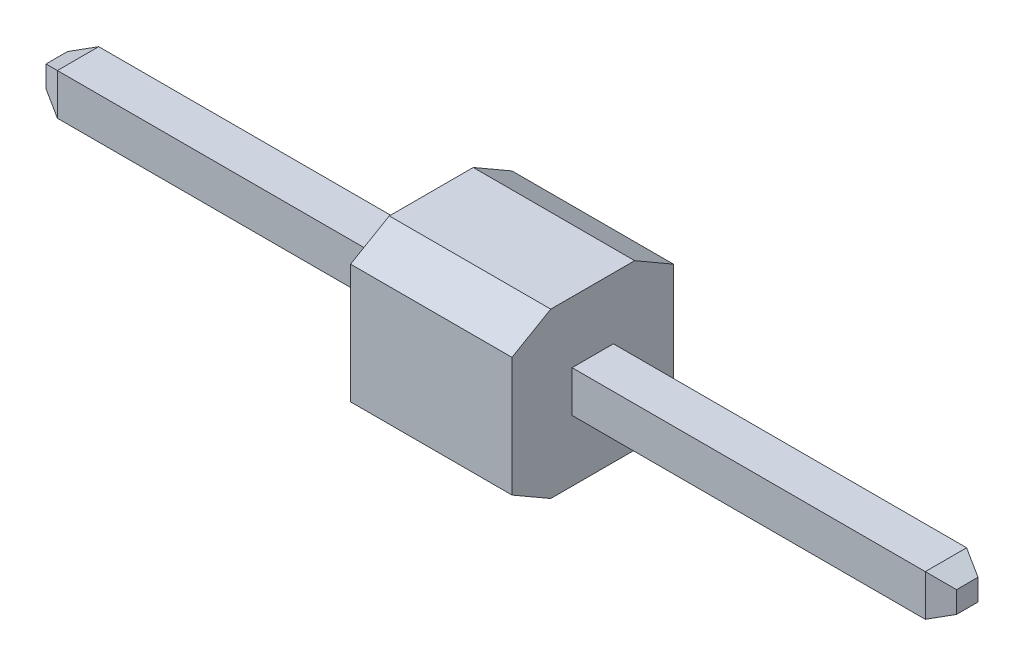
ISO-10303-21;
HEADER;
FILE_DESCRIPTION(('STEP AP214'),'2;1');
FILE_NAME('part.step','',(''),(''),'','','');
FILE_SCHEMA(('AUTOMOTIVE_DESIGN { 1 0 10303 214 1 1 1 1 }'));
ENDSEC;
DATA;
#1=APPLICATION_CONTEXT('core data for automotive mechanical design processes');
#2=APPLICATION_PROTOCOL_DEFINITION('international standard','automotive_design',2000,#1);
#3=PRODUCT_CONTEXT('',#1,'mechanical');
#4=PRODUCT('Part','Part','',(#3));
#5=PRODUCT_RELATED_PRODUCT_CATEGORY('part','',(#4));
#6=PRODUCT_DEFINITION_FORMATION('','',#4);
#7=PRODUCT_DEFINITION_CONTEXT('part definition',#1,'design');
#8=PRODUCT_DEFINITION('design','',#6,#7);
#9=PRODUCT_DEFINITION_SHAPE('','',#8);
#10=(LENGTH_UNIT() NAMED_UNIT(*) SI_UNIT(.MILLI.,.METRE.));
#11=(NAMED_UNIT(*) PLANE_ANGLE_UNIT() SI_UNIT($,.RADIAN.));
#12=(NAMED_UNIT(*) SI_UNIT($,.STERADIAN.) SOLID_ANGLE_UNIT());
#13=UNCERTAINTY_MEASURE_WITH_UNIT(LENGTH_MEASURE(1.E-05),#10,'distance_accuracy_value','');
#14=(GEOMETRIC_REPRESENTATION_CONTEXT(3) GLOBAL_UNCERTAINTY_ASSIGNED_CONTEXT((#13)) GLOBAL_UNIT_ASSIGNED_CONTEXT((#10,
#11,#12)) REPRESENTATION_CONTEXT('',''));
#15=CARTESIAN_POINT('',(0.,0.,0.));
#16=DIRECTION('',(0.,0.,1.));
#17=DIRECTION('',(1.,0.,0.));
#18=AXIS2_PLACEMENT_3D('',#15,#16,#17);
#19=CARTESIAN_POINT('',(5.42107494554601,-0.317128262913911,0.629998634255617));
#20=DIRECTION('',(1.,4.37113882867379E-08,-4.37113882867379E-08));
#21=DIRECTION('',(-4.37113882867379E-08,1.,0.));
#22=AXIS2_PLACEMENT_3D('',#19,#20,#21);
#23=PLANE('',#22);
#24=DIRECTION('',(1.59994777304463E-08,0.500000000000192,0.866025403784328));
#25=VECTOR('',#24,1.);
#26=CARTESIAN_POINT('',(5.42107482256009,0.926461575576084,-0.940001365744382));
#27=LINE('',#26,#25);
#28=CARTESIAN_POINT('',(5.42107482256009,0.926461575576084,-0.940001365744382));
#29=VERTEX_POINT('',#28);
#30=CARTESIAN_POINT('',(5.42107483364485,1.27287173708609,-0.340001365744383));
#31=VERTEX_POINT('',#30);
#32=EDGE_CURVE('E11',#29,#31,#27,.T.);
#33=ORIENTED_EDGE('',*,*,#32,.T.);
#34=DIRECTION('',(4.37113886966664E-08,0.,0.999999999999999));
#35=VECTOR('',#34,1.);
#36=CARTESIAN_POINT('',(5.42107483364485,1.27287173708609,-0.340001365744383));
#37=LINE('',#36,#35);
#38=CARTESIAN_POINT('',(5.42107489046966,1.27287173708609,0.959998634255618));
#39=VERTEX_POINT('',#38);
#40=EDGE_CURVE('E304',#31,#39,#37,.T.);
#41=ORIENTED_EDGE('',*,*,#40,.T.);
#42=DIRECTION('',(5.9710866882576E-08,-0.500000000000187,0.866025403784329));
#43=VECTOR('',#42,1.);
#44=CARTESIAN_POINT('',(5.42107489046966,1.27287173708609,0.959998634255618));
#45=LINE('',#44,#43);
#46=CARTESIAN_POINT('',(5.42107493183856,0.92646157557609,1.55999863425562));
#47=VERTEX_POINT('',#46);
#48=EDGE_CURVE('E296',#39,#47,#45,.T.);
#49=ORIENTED_EDGE('',*,*,#48,.T.);
#50=DIRECTION('',(4.37113884815545E-08,-0.999999999999999,0.));
#51=VECTOR('',#50,1.);
#52=CARTESIAN_POINT('',(5.42107493183856,0.92646157557609,1.55999863425562));
#53=LINE('',#52,#51);
#54=CARTESIAN_POINT('',(5.42107501258135,-0.920718101393911,1.55999863425562));
#55=VERTEX_POINT('',#54);
#56=EDGE_CURVE('E281',#47,#55,#53,.T.);
#57=ORIENTED_EDGE('',*,*,#56,.T.);
#58=DIRECTION('',(1.5999479012306E-08,0.500000000000192,0.866025403784328));
#59=VECTOR('',#58,1.);
#60=CARTESIAN_POINT('',(5.42107500149658,-1.26712826291391,0.959998634255618));
#61=LINE('',#60,#59);
#62=CARTESIAN_POINT('',(5.42107500149658,-1.26712826291391,0.959998634255618));
#63=VERTEX_POINT('',#62);
#64=EDGE_CURVE('E265',#63,#55,#61,.T.);
#65=ORIENTED_EDGE('',*,*,#64,.F.);
#66=DIRECTION('',(4.37113886966664E-08,0.,0.999999999999999));
#67=VECTOR('',#66,1.);
#68=CARTESIAN_POINT('',(5.42107494467178,-1.26712826291391,-0.340001365744383));
#69=LINE('',#68,#67);
#70=CARTESIAN_POINT('',(5.42107494467178,-1.26712826291391,-0.340001365744383));
#71=VERTEX_POINT('',#70);
#72=EDGE_CURVE('E248',#71,#63,#69,.T.);
#73=ORIENTED_EDGE('',*,*,#72,.F.);
#74=DIRECTION('',(5.97108656001699E-08,-0.500000000000189,0.866025403784328));
#75=VECTOR('',#74,1.);
#76=CARTESIAN_POINT('',(5.42107490330288,-0.920718101393916,-0.940001365744382));
#77=LINE('',#76,#75);
#78=CARTESIAN_POINT('',(5.42107490330288,-0.920718101393916,-0.940001365744382));
#79=VERTEX_POINT('',#78);
#80=EDGE_CURVE('E242',#79,#71,#77,.T.);
#81=ORIENTED_EDGE('',*,*,#80,.F.);
#82=DIRECTION('',(4.37113884815545E-08,-0.999999999999999,0.));
#83=VECTOR('',#82,1.);
#84=CARTESIAN_POINT('',(5.42107482256009,0.926461575576084,-0.940001365744382));
#85=LINE('',#84,#83);
#86=EDGE_CURVE('E236',#29,#79,#85,.T.);
#87=ORIENTED_EDGE('',*,*,#86,.F.);
#88=EDGE_LOOP('',(#33,#41,#49,#57,#65,#73,#81,#87));
#89=FACE_BOUND('',#88,.T.);
#90=DIRECTION('',(-4.37113886753159E-08,0.,-0.999999999999999));
#91=VECTOR('',#90,1.);
#92=CARTESIAN_POINT('',(5.42107491757072,0.322871737086087,0.629998634255617));
#93=LINE('',#92,#91);
#94=CARTESIAN_POINT('',(5.42107491757072,0.322871737086087,0.629998634255617));
#95=VERTEX_POINT('',#94);
#96=CARTESIAN_POINT('',(5.42107488959543,0.322871737086086,-0.0100013657443826));
#97=VERTEX_POINT('',#96);
#98=EDGE_CURVE('E302',#95,#97,#93,.T.);
#99=ORIENTED_EDGE('',*,*,#98,.T.);
#100=DIRECTION('',(-4.3711388675316E-08,0.999999999999999,0.));
#101=VECTOR('',#100,1.);
#102=CARTESIAN_POINT('',(5.42107491757072,-0.317128262913913,-0.0100013657443826));
#103=LINE('',#102,#101);
#104=CARTESIAN_POINT('',(5.42107491757072,-0.317128262913913,-0.0100013657443826));
#105=VERTEX_POINT('',#104);
#106=EDGE_CURVE('E293',#105,#97,#103,.T.);
#107=ORIENTED_EDGE('',*,*,#106,.F.);
#108=DIRECTION('',(-4.37113886753159E-08,0.,-0.999999999999999));
#109=VECTOR('',#108,1.);
#110=CARTESIAN_POINT('',(5.42107494554601,-0.317128262913911,0.629998634255617));
#111=LINE('',#110,#109);
#112=CARTESIAN_POINT('',(5.42107494554601,-0.317128262913911,0.629998634255617));
#113=VERTEX_POINT('',#112);
#114=EDGE_CURVE('E278',#113,#105,#111,.T.);
#115=ORIENTED_EDGE('',*,*,#114,.F.);
#116=DIRECTION('',(-4.3711388675316E-08,0.999999999999999,0.));
#117=VECTOR('',#116,1.);
#118=CARTESIAN_POINT('',(5.42107494554601,-0.317128262913911,0.629998634255617));
#119=LINE('',#118,#117);
#120=EDGE_CURVE('E263',#113,#95,#119,.T.);
#121=ORIENTED_EDGE('',*,*,#120,.T.);
#122=EDGE_LOOP('',(#99,#107,#115,#121));
#123=FACE_BOUND('',#122,.T.);
#124=ADVANCED_FACE('F17',(#89,#123),#23,.T.);
#125=CARTESIAN_POINT('',(2.92107494554601,-0.317128372192382,0.629998743534088));
#126=DIRECTION('',(1.,4.37113882867379E-08,-4.37113882867379E-08));
#127=DIRECTION('',(-4.37113882867379E-08,1.,0.));
#128=AXIS2_PLACEMENT_3D('',#125,#126,#127);
#129=PLANE('',#128);
#130=DIRECTION('',(1.59994783714339E-08,0.500000000000192,0.866025403784328));
#131=VECTOR('',#130,1.);
#132=CARTESIAN_POINT('',(2.92107482256009,0.926461466297614,-0.940001256465912));
#133=LINE('',#132,#131);
#134=CARTESIAN_POINT('',(2.92107482256009,0.926461466297614,-0.940001256465912));
#135=VERTEX_POINT('',#134);
#136=CARTESIAN_POINT('',(2.92107483364485,1.27287162780762,-0.340001256465912));
#137=VERTEX_POINT('',#136);
#138=EDGE_CURVE('E24',#135,#137,#133,.T.);
#139=ORIENTED_EDGE('',*,*,#138,.F.);
#140=DIRECTION('',(4.37113882411397E-08,-0.999999999999999,0.));
#141=VECTOR('',#140,1.);
#142=CARTESIAN_POINT('',(2.92107482256009,0.926461466297614,-0.940001256465912));
#143=LINE('',#142,#141);
#144=CARTESIAN_POINT('',(2.92107490330288,-0.920718210672387,-0.940001256465912));
#145=VERTEX_POINT('',#144);
#146=EDGE_CURVE('E300',#135,#145,#143,.T.);
#147=ORIENTED_EDGE('',*,*,#146,.T.);
#148=DIRECTION('',(5.97108668821451E-08,-0.500000000000189,0.866025403784328));
#149=VECTOR('',#148,1.);
#150=CARTESIAN_POINT('',(2.92107490330288,-0.920718210672387,-0.940001256465912));
#151=LINE('',#150,#149);
#152=CARTESIAN_POINT('',(2.92107494467178,-1.26712837219238,-0.340001256465912));
#153=VERTEX_POINT('',#152);
#154=EDGE_CURVE('E286',#145,#153,#151,.T.);
#155=ORIENTED_EDGE('',*,*,#154,.T.);
#156=DIRECTION('',(4.37113883550593E-08,0.,0.999999999999999));
#157=VECTOR('',#156,1.);
#158=CARTESIAN_POINT('',(2.92107494467178,-1.26712837219238,-0.340001256465912));
#159=LINE('',#158,#157);
#160=CARTESIAN_POINT('',(2.92107500149659,-1.26712837219238,0.959998743534088));
#161=VERTEX_POINT('',#160);
#162=EDGE_CURVE('E271',#153,#161,#159,.T.);
#163=ORIENTED_EDGE('',*,*,#162,.T.);
#164=DIRECTION('',(1.59994783713184E-08,0.500000000000192,0.866025403784328));
#165=VECTOR('',#164,1.);
#166=CARTESIAN_POINT('',(2.92107500149659,-1.26712837219238,0.959998743534088));
#167=LINE('',#166,#165);
#168=CARTESIAN_POINT('',(2.92107501258135,-0.920718210672382,1.55999874353409));
#169=VERTEX_POINT('',#168);
#170=EDGE_CURVE('E253',#161,#169,#167,.T.);
#171=ORIENTED_EDGE('',*,*,#170,.T.);
#172=DIRECTION('',(4.37113882411397E-08,-0.999999999999999,0.));
#173=VECTOR('',#172,1.);
#174=CARTESIAN_POINT('',(2.92107493183856,0.926461466297619,1.55999874353409));
#175=LINE('',#174,#173);
#176=CARTESIAN_POINT('',(2.92107493183856,0.926461466297619,1.55999874353409));
#177=VERTEX_POINT('',#176);
#178=EDGE_CURVE('E261',#177,#169,#175,.T.);
#179=ORIENTED_EDGE('',*,*,#178,.F.);
#180=DIRECTION('',(5.9710866882576E-08,-0.500000000000187,0.866025403784329));
#181=VECTOR('',#180,1.);
#182=CARTESIAN_POINT('',(2.92107489046966,1.27287162780762,0.959998743534088));
#183=LINE('',#182,#181);
#184=CARTESIAN_POINT('',(2.92107489046966,1.27287162780762,0.959998743534088));
#185=VERTEX_POINT('',#184);
#186=EDGE_CURVE('E276',#185,#177,#183,.T.);
#187=ORIENTED_EDGE('',*,*,#186,.F.);
#188=DIRECTION('',(4.37113883550593E-08,0.,0.999999999999999));
#189=VECTOR('',#188,1.);
#190=CARTESIAN_POINT('',(2.92107483364485,1.27287162780762,-0.340001256465912));
#191=LINE('',#190,#189);
#192=EDGE_CURVE('E291',#137,#185,#191,.T.);
#193=ORIENTED_EDGE('',*,*,#192,.F.);
#194=EDGE_LOOP('',(#139,#147,#155,#163,#171,#179,#187,#193));
#195=FACE_BOUND('',#194,.T.);
#196=DIRECTION('',(-4.3711388675316E-08,0.999999999999999,0.));
#197=VECTOR('',#196,1.);
#198=CARTESIAN_POINT('',(2.92107491757072,-0.317128372192384,-0.0100012564659119));
#199=LINE('',#198,#197);
#200=CARTESIAN_POINT('',(2.92107491757072,-0.317128372192384,-0.0100012564659119));
#201=VERTEX_POINT('',#200);
#202=CARTESIAN_POINT('',(2.92107488959543,0.322871627807615,-0.0100012564659119));
#203=VERTEX_POINT('',#202);
#204=EDGE_CURVE('E298',#201,#203,#199,.T.);
#205=ORIENTED_EDGE('',*,*,#204,.T.);
#206=DIRECTION('',(-4.37113886753159E-08,0.,-0.999999999999999));
#207=VECTOR('',#206,1.);
#208=CARTESIAN_POINT('',(2.92107491757072,0.322871627807617,0.629998743534088));
#209=LINE('',#208,#207);
#210=CARTESIAN_POINT('',(2.92107491757072,0.322871627807617,0.629998743534088));
#211=VERTEX_POINT('',#210);
#212=EDGE_CURVE('E283',#211,#203,#209,.T.);
#213=ORIENTED_EDGE('',*,*,#212,.F.);
#214=DIRECTION('',(-4.37113879814266E-08,0.999999999999999,0.));
#215=VECTOR('',#214,1.);
#216=CARTESIAN_POINT('',(2.92107494554601,-0.317128372192382,0.629998743534088));
#217=LINE('',#216,#215);
#218=CARTESIAN_POINT('',(2.92107494554601,-0.317128372192382,0.629998743534088));
#219=VERTEX_POINT('',#218);
#220=EDGE_CURVE('E268',#219,#211,#217,.T.);
#221=ORIENTED_EDGE('',*,*,#220,.F.);
#222=DIRECTION('',(-4.37113879814266E-08,0.,-0.999999999999999));
#223=VECTOR('',#222,1.);
#224=CARTESIAN_POINT('',(2.92107494554601,-0.317128372192382,0.629998743534088));
#225=LINE('',#224,#223);
#226=EDGE_CURVE('E251',#219,#201,#225,.T.);
#227=ORIENTED_EDGE('',*,*,#226,.T.);
#228=EDGE_LOOP('',(#205,#213,#221,#227));
#229=FACE_BOUND('',#228,.T.);
#230=ADVANCED_FACE('F314',(#195,#229),#129,.F.);
#231=CARTESIAN_POINT('',(5.42107482256009,0.926461575576084,-0.940001365744382));
#232=DIRECTION('',(5.97108668343731E-08,-0.866025403784328,0.50000000000019));
#233=DIRECTION('',(-1.59994785476185E-08,-0.500000000000192,-0.866025403784329));
#234=AXIS2_PLACEMENT_3D('',#231,#232,#233);
#235=PLANE('',#234);
#236=ORIENTED_EDGE('',*,*,#138,.T.);
#237=DIRECTION('',(-0.999999999999998,-4.37113882867378E-08,4.37113883755557E-08));
#238=VECTOR('',#237,1.);
#239=CARTESIAN_POINT('',(5.42107483364485,1.27287173708609,-0.340001365744383));
#240=LINE('',#239,#238);
#241=EDGE_CURVE('E288',#31,#137,#240,.T.);
#242=ORIENTED_EDGE('',*,*,#241,.F.);
#243=ORIENTED_EDGE('',*,*,#32,.F.);
#244=DIRECTION('',(-0.999999999999998,-4.37113882867378E-08,4.37113881091022E-08));
#245=VECTOR('',#244,1.);
#246=CARTESIAN_POINT('',(5.42107482256009,0.926461575576084,-0.940001365744382));
#247=LINE('',#246,#245);
#248=EDGE_CURVE('E256',#29,#135,#247,.T.);
#249=ORIENTED_EDGE('',*,*,#248,.T.);
#250=EDGE_LOOP('',(#236,#242,#243,#249));
#251=FACE_BOUND('',#250,.T.);
#252=ADVANCED_FACE('F306',(#251),#235,.F.);
#253=CARTESIAN_POINT('',(5.42107483364485,1.27287173708609,-0.340001365744383));
#254=DIRECTION('',(4.37113882867379E-08,-1.,0.));
#255=DIRECTION('',(1.,4.37113882867379E-08,-4.37113882867379E-08));
#256=AXIS2_PLACEMENT_3D('',#253,#254,#255);
#257=PLANE('',#256);
#258=ORIENTED_EDGE('',*,*,#192,.T.);
#259=DIRECTION('',(-0.999999999999998,-4.37113882867378E-08,4.37113882867378E-08));
#260=VECTOR('',#259,1.);
#261=CARTESIAN_POINT('',(5.42107489046966,1.27287173708609,0.959998634255618));
#262=LINE('',#261,#260);
#263=EDGE_CURVE('E273',#39,#185,#262,.T.);
#264=ORIENTED_EDGE('',*,*,#263,.F.);
#265=ORIENTED_EDGE('',*,*,#40,.F.);
#266=ORIENTED_EDGE('',*,*,#241,.T.);
#267=EDGE_LOOP('',(#258,#264,#265,#266));
#268=FACE_BOUND('',#267,.T.);
#269=ADVANCED_FACE('F311',(#268),#257,.F.);
#270=CARTESIAN_POINT('',(5.42107489046966,1.27287173708609,0.959998634255618));
#271=DIRECTION('',(1.59994785476185E-08,-0.86602540378433,-0.50000000000019));
#272=DIRECTION('',(-5.97108668343731E-08,0.500000000000188,-0.866025403784329));
#273=AXIS2_PLACEMENT_3D('',#270,#271,#272);
#274=PLANE('',#273);
#275=ORIENTED_EDGE('',*,*,#186,.T.);
#276=DIRECTION('',(-0.999999999999998,-4.37113882867378E-08,4.37113882867378E-08));
#277=VECTOR('',#276,1.);
#278=CARTESIAN_POINT('',(5.42107493183856,0.92646157557609,1.55999863425562));
#279=LINE('',#278,#277);
#280=EDGE_CURVE('E258',#47,#177,#279,.T.);
#281=ORIENTED_EDGE('',*,*,#280,.F.);
#282=ORIENTED_EDGE('',*,*,#48,.F.);
#283=ORIENTED_EDGE('',*,*,#263,.T.);
#284=EDGE_LOOP('',(#275,#281,#282,#283));
#285=FACE_BOUND('',#284,.T.);
#286=ADVANCED_FACE('F319',(#285),#274,.F.);
#287=CARTESIAN_POINT('',(5.42107493183856,0.92646157557609,1.55999863425562));
#288=DIRECTION('',(-4.37113882867379E-08,0.,-1.));
#289=DIRECTION('',(-1.,-4.37113882867379E-08,4.37113882867379E-08));
#290=AXIS2_PLACEMENT_3D('',#287,#288,#289);
#291=PLANE('',#290);
#292=ORIENTED_EDGE('',*,*,#178,.T.);
#293=DIRECTION('',(-0.999999999999998,-4.37113897078233E-08,4.37113882867378E-08));
#294=VECTOR('',#293,1.);
#295=CARTESIAN_POINT('',(5.42107501258135,-0.920718101393911,1.55999863425562));
#296=LINE('',#295,#294);
#297=EDGE_CURVE('E245',#55,#169,#296,.T.);
#298=ORIENTED_EDGE('',*,*,#297,.F.);
#299=ORIENTED_EDGE('',*,*,#56,.F.);
#300=ORIENTED_EDGE('',*,*,#280,.T.);
#301=EDGE_LOOP('',(#292,#298,#299,#300));
#302=FACE_BOUND('',#301,.T.);
#303=ADVANCED_FACE('F326',(#302),#291,.F.);
#304=CARTESIAN_POINT('',(5.42107500149658,-1.26712826291391,0.959998634255618));
#305=DIRECTION('',(5.97108668343731E-08,-0.866025403784328,0.50000000000019));
#306=DIRECTION('',(-1.59994785476185E-08,-0.500000000000192,-0.866025403784329));
#307=AXIS2_PLACEMENT_3D('',#304,#305,#306);
#308=PLANE('',#307);
#309=ORIENTED_EDGE('',*,*,#170,.F.);
#310=DIRECTION('',(-0.999999999999998,-4.37113875761951E-08,4.37113882867378E-08));
#311=VECTOR('',#310,1.);
#312=CARTESIAN_POINT('',(5.42107500149658,-1.26712826291391,0.959998634255618));
#313=LINE('',#312,#311);
#314=EDGE_CURVE('E239',#63,#161,#313,.T.);
#315=ORIENTED_EDGE('',*,*,#314,.F.);
#316=ORIENTED_EDGE('',*,*,#64,.T.);
#317=ORIENTED_EDGE('',*,*,#297,.T.);
#318=EDGE_LOOP('',(#309,#315,#316,#317));
#319=FACE_BOUND('',#318,.T.);
#320=ADVANCED_FACE('F329',(#319),#308,.T.);
#321=CARTESIAN_POINT('',(5.42107494467178,-1.26712826291391,-0.340001365744383));
#322=DIRECTION('',(4.37113882867379E-08,-1.,0.));
#323=DIRECTION('',(1.,4.37113882867379E-08,-4.37113882867379E-08));
#324=AXIS2_PLACEMENT_3D('',#321,#322,#323);
#325=PLANE('',#324);
#326=ORIENTED_EDGE('',*,*,#162,.F.);
#327=DIRECTION('',(-0.999999999999998,-4.37113875761951E-08,4.37113883755557E-08));
#328=VECTOR('',#327,1.);
#329=CARTESIAN_POINT('',(5.42107494467178,-1.26712826291391,-0.340001365744383));
#330=LINE('',#329,#328);
#331=EDGE_CURVE('E233',#71,#153,#330,.T.);
#332=ORIENTED_EDGE('',*,*,#331,.F.);
#333=ORIENTED_EDGE('',*,*,#72,.T.);
#334=ORIENTED_EDGE('',*,*,#314,.T.);
#335=EDGE_LOOP('',(#326,#332,#333,#334));
#336=FACE_BOUND('',#335,.T.);
#337=ADVANCED_FACE('F333',(#336),#325,.T.);
#338=CARTESIAN_POINT('',(5.42107490330288,-0.920718101393916,-0.940001365744382));
#339=DIRECTION('',(1.59994785476185E-08,-0.86602540378433,-0.50000000000019));
#340=DIRECTION('',(-5.97108668343731E-08,0.500000000000188,-0.866025403784329));
#341=AXIS2_PLACEMENT_3D('',#338,#339,#340);
#342=PLANE('',#341);
#343=ORIENTED_EDGE('',*,*,#154,.F.);
#344=DIRECTION('',(-0.999999999999998,-4.37113897078233E-08,4.37113881091021E-08));
#345=VECTOR('',#344,1.);
#346=CARTESIAN_POINT('',(5.42107490330288,-0.920718101393916,-0.940001365744382));
#347=LINE('',#346,#345);
#348=EDGE_CURVE('E230',#79,#145,#347,.T.);
#349=ORIENTED_EDGE('',*,*,#348,.F.);
#350=ORIENTED_EDGE('',*,*,#80,.T.);
#351=ORIENTED_EDGE('',*,*,#331,.T.);
#352=EDGE_LOOP('',(#343,#349,#350,#351));
#353=FACE_BOUND('',#352,.T.);
#354=ADVANCED_FACE('F337',(#353),#342,.T.);
#355=CARTESIAN_POINT('',(5.42107482256009,0.926461575576084,-0.940001365744382));
#356=DIRECTION('',(-4.37113882867379E-08,0.,-1.));
#357=DIRECTION('',(-4.37113882867379E-08,1.,0.));
#358=AXIS2_PLACEMENT_3D('',#355,#356,#357);
#359=PLANE('',#358);
#360=ORIENTED_EDGE('',*,*,#146,.F.);
#361=ORIENTED_EDGE('',*,*,#248,.F.);
#362=ORIENTED_EDGE('',*,*,#86,.T.);
#363=ORIENTED_EDGE('',*,*,#348,.T.);
#364=EDGE_LOOP('',(#360,#361,#362,#363));
#365=FACE_BOUND('',#364,.T.);
#366=ADVANCED_FACE('F339',(#365),#359,.T.);
#367=CARTESIAN_POINT('',(-2.87892505445399,-0.317128625718434,0.62999899706014));
#368=DIRECTION('',(-1.,-4.37113882867379E-08,4.37113882867379E-08));
#369=DIRECTION('',(4.37113882867379E-08,-1.,0.));
#370=AXIS2_PLACEMENT_3D('',#367,#368,#369);
#371=PLANE('',#370);
#372=DIRECTION('',(4.37113900757526E-08,-0.999999999999999,0.));
#373=VECTOR('',#372,1.);
#374=CARTESIAN_POINT('',(-2.87892509695182,0.168989847091563,0.14388052425114));
#375=LINE('',#374,#373);
#376=CARTESIAN_POINT('',(-2.87892509695182,0.168989847091563,0.14388052425114));
#377=VERTEX_POINT('',#376);
#378=CARTESIAN_POINT('',(-2.87892508242928,-0.163247098518436,0.14388052425114));
#379=VERTEX_POINT('',#378);
#380=EDGE_CURVE('E228',#377,#379,#375,.T.);
#381=ORIENTED_EDGE('',*,*,#380,.T.);
#382=DIRECTION('',(4.37113874013716E-08,0.,0.999999999999999));
#383=VECTOR('',#382,1.);
#384=CARTESIAN_POINT('',(-2.87892508242928,-0.163247098518436,0.14388052425114));
#385=LINE('',#384,#383);
#386=CARTESIAN_POINT('',(-2.87892506790674,-0.163247098518434,0.47611746986914));
#387=VERTEX_POINT('',#386);
#388=EDGE_CURVE('E223',#379,#387,#385,.T.);
#389=ORIENTED_EDGE('',*,*,#388,.T.);
#390=DIRECTION('',(-4.37113847290958E-08,0.999999999999999,0.));
#391=VECTOR('',#390,1.);
#392=CARTESIAN_POINT('',(-2.87892506790674,-0.163247098518436,0.47611746986914));
#393=LINE('',#392,#391);
#394=CARTESIAN_POINT('',(-2.87892508242928,0.168989847091565,0.47611746986914));
#395=VERTEX_POINT('',#394);
#396=EDGE_CURVE('E215',#387,#395,#393,.T.);
#397=ORIENTED_EDGE('',*,*,#396,.T.);
#398=DIRECTION('',(-4.37113820547151E-08,0.,-0.999999999999999));
#399=VECTOR('',#398,1.);
#400=CARTESIAN_POINT('',(-2.87892508242928,0.168989847091565,0.47611746986914));
#401=LINE('',#400,#399);
#402=EDGE_CURVE('E207',#395,#377,#401,.T.);
#403=ORIENTED_EDGE('',*,*,#402,.T.);
#404=EDGE_LOOP('',(#381,#389,#397,#403));
#405=FACE_BOUND('',#404,.T.);
#406=ADVANCED_FACE('F341',(#405),#371,.T.);
#407=CARTESIAN_POINT('',(-2.87892505445399,-0.317128625718434,0.62999899706014));
#408=DIRECTION('',(4.37113882867379E-08,-1.,0.));
#409=DIRECTION('',(-4.37113882867379E-08,0.,-1.));
#410=AXIS2_PLACEMENT_3D('',#407,#408,#409);
#411=PLANE('',#410);
#412=DIRECTION('',(0.999999999999998,4.37113875463186E-08,-4.37113882769955E-08));
#413=VECTOR('',#412,1.);
#414=CARTESIAN_POINT('',(-2.54892505445399,-0.317128611293676,0.629998982635382));
#415=LINE('',#414,#413);
#416=CARTESIAN_POINT('',(-2.54892505445399,-0.317128611293676,0.629998982635382));
#417=VERTEX_POINT('',#416);
#418=EDGE_CURVE('E225',#417,#219,#415,.T.);
#419=ORIENTED_EDGE('',*,*,#418,.F.);
#420=DIRECTION('',(-4.37113886753159E-08,0.,-0.999999999999999));
#421=VECTOR('',#420,1.);
#422=CARTESIAN_POINT('',(-2.54892505445399,-0.317128611293676,0.629998982635382));
#423=LINE('',#422,#421);
#424=CARTESIAN_POINT('',(-2.54892508242928,-0.317128611293677,-0.010001017364618));
#425=VERTEX_POINT('',#424);
#426=EDGE_CURVE('E217',#417,#425,#423,.T.);
#427=ORIENTED_EDGE('',*,*,#426,.T.);
#428=DIRECTION('',(0.999999999999998,4.37113875463185E-08,-4.37113882161057E-08));
#429=VECTOR('',#428,1.);
#430=CARTESIAN_POINT('',(-2.54892508242928,-0.317128611293677,-0.010001017364618));
#431=LINE('',#430,#429);
#432=EDGE_CURVE('E220',#425,#201,#431,.T.);
#433=ORIENTED_EDGE('',*,*,#432,.T.);
#434=ORIENTED_EDGE('',*,*,#226,.F.);
#435=EDGE_LOOP('',(#419,#427,#433,#434));
#436=FACE_BOUND('',#435,.T.);
#437=ADVANCED_FACE('F348',(#436),#411,.T.);
#438=CARTESIAN_POINT('',(-2.87892508242928,-0.317128625718436,-0.0100010029398598));
#439=DIRECTION('',(-4.37113882867379E-08,0.,-1.));
#440=DIRECTION('',(-1.,-4.37113882867379E-08,4.37113882867379E-08));
#441=AXIS2_PLACEMENT_3D('',#438,#439,#440);
#442=PLANE('',#441);
#443=ORIENTED_EDGE('',*,*,#432,.F.);
#444=DIRECTION('',(-4.3711388675316E-08,0.999999999999999,0.));
#445=VECTOR('',#444,1.);
#446=CARTESIAN_POINT('',(-2.54892508242928,-0.317128611293677,-0.010001017364618));
#447=LINE('',#446,#445);
#448=CARTESIAN_POINT('',(-2.54892511040457,0.322871388706321,-0.010001017364618));
#449=VERTEX_POINT('',#448);
#450=EDGE_CURVE('E209',#425,#449,#447,.T.);
#451=ORIENTED_EDGE('',*,*,#450,.T.);
#452=DIRECTION('',(0.999999999999998,4.37113865720826E-08,-4.37113882161057E-08));
#453=VECTOR('',#452,1.);
#454=CARTESIAN_POINT('',(-2.54892511040457,0.322871388706321,-0.010001017364618));
#455=LINE('',#454,#453);
#456=EDGE_CURVE('E212',#449,#203,#455,.T.);
#457=ORIENTED_EDGE('',*,*,#456,.T.);
#458=ORIENTED_EDGE('',*,*,#204,.F.);
#459=EDGE_LOOP('',(#443,#451,#457,#458));
#460=FACE_BOUND('',#459,.T.);
#461=ADVANCED_FACE('F424',(#460),#442,.T.);
#462=CARTESIAN_POINT('',(-2.87892508242928,0.322871374281565,0.62999899706014));
#463=DIRECTION('',(4.37113882867379E-08,-1.,0.));
#464=DIRECTION('',(-4.37113882867379E-08,0.,-1.));
#465=AXIS2_PLACEMENT_3D('',#462,#463,#464);
#466=PLANE('',#465);
#467=ORIENTED_EDGE('',*,*,#456,.F.);
#468=DIRECTION('',(4.37113900630947E-08,0.,0.999999999999999));
#469=VECTOR('',#468,1.);
#470=CARTESIAN_POINT('',(-2.54892511040457,0.322871388706321,-0.010001017364618));
#471=LINE('',#470,#469);
#472=CARTESIAN_POINT('',(-2.54892508242928,0.322871388706323,0.629998982635382));
#473=VERTEX_POINT('',#472);
#474=EDGE_CURVE('E201',#449,#473,#471,.T.);
#475=ORIENTED_EDGE('',*,*,#474,.T.);
#476=DIRECTION('',(0.999999999999998,4.37113865720826E-08,-4.37113882769955E-08));
#477=VECTOR('',#476,1.);
#478=CARTESIAN_POINT('',(-2.54892508242928,0.322871388706323,0.629998982635382));
#479=LINE('',#478,#477);
#480=EDGE_CURVE('E204',#473,#211,#479,.T.);
#481=ORIENTED_EDGE('',*,*,#480,.T.);
#482=ORIENTED_EDGE('',*,*,#212,.T.);
#483=EDGE_LOOP('',(#467,#475,#481,#482));
#484=FACE_BOUND('',#483,.T.);
#485=ADVANCED_FACE('F421',(#484),#466,.F.);
#486=CARTESIAN_POINT('',(-2.87892505445399,-0.317128625718434,0.62999899706014));
#487=DIRECTION('',(-4.37113882867379E-08,0.,-1.));
#488=DIRECTION('',(-1.,-4.37113882867379E-08,4.37113882867379E-08));
#489=AXIS2_PLACEMENT_3D('',#486,#487,#488);
#490=PLANE('',#489);
#491=ORIENTED_EDGE('',*,*,#480,.F.);
#492=DIRECTION('',(4.37113900630949E-08,-0.999999999999999,0.));
#493=VECTOR('',#492,1.);
#494=CARTESIAN_POINT('',(-2.54892508242928,0.322871388706321,0.629998982635382));
#495=LINE('',#494,#493);
#496=EDGE_CURVE('E196',#473,#417,#495,.T.);
#497=ORIENTED_EDGE('',*,*,#496,.T.);
#498=ORIENTED_EDGE('',*,*,#418,.T.);
#499=ORIENTED_EDGE('',*,*,#220,.T.);
#500=EDGE_LOOP('',(#491,#497,#498,#499));
#501=FACE_BOUND('',#500,.T.);
#502=ADVANCED_FACE('F376',(#501),#490,.F.);
#503=CARTESIAN_POINT('',(-2.87892505445399,-0.317128625718434,0.62999899706014));
#504=DIRECTION('',(-4.37113882867379E-08,0.,-1.));
#505=DIRECTION('',(-1.,-4.37113882867379E-08,4.37113882867379E-08));
#506=AXIS2_PLACEMENT_3D('',#503,#504,#505);
#507=PLANE('',#506);
#508=DIRECTION('',(0.999999999999998,4.37113829998842E-08,-4.37113882769955E-08));
#509=VECTOR('',#508,1.);
#510=CARTESIAN_POINT('',(5.42107494554601,-0.317128262913901,0.629998634255617));
#511=LINE('',#510,#509);
#512=CARTESIAN_POINT('',(10.891074945546,-0.317128023812618,0.629998395154324));
#513=VERTEX_POINT('',#512);
#514=EDGE_CURVE('E199',#113,#513,#511,.T.);
#515=ORIENTED_EDGE('',*,*,#514,.T.);
#516=DIRECTION('',(-4.37113900630948E-08,0.999999999999999,0.));
#517=VECTOR('',#516,1.);
#518=CARTESIAN_POINT('',(10.891074945546,-0.317128023812618,0.629998395154324));
#519=LINE('',#518,#517);
#520=CARTESIAN_POINT('',(10.8910749175707,0.322871976187381,0.629998395154324));
#521=VERTEX_POINT('',#520);
#522=EDGE_CURVE('E191',#513,#521,#519,.T.);
#523=ORIENTED_EDGE('',*,*,#522,.T.);
#524=DIRECTION('',(0.999999999999998,4.37113881958092E-08,-4.37113882769955E-08));
#525=VECTOR('',#524,1.);
#526=CARTESIAN_POINT('',(5.42107491757072,0.322871737086086,0.629998634255617));
#527=LINE('',#526,#525);
#528=EDGE_CURVE('E194',#95,#521,#527,.T.);
#529=ORIENTED_EDGE('',*,*,#528,.F.);
#530=ORIENTED_EDGE('',*,*,#120,.F.);
#531=EDGE_LOOP('',(#515,#523,#529,#530));
#532=FACE_BOUND('',#531,.T.);
#533=ADVANCED_FACE('F367',(#532),#507,.F.);
#534=CARTESIAN_POINT('',(-2.87892508242928,0.322871374281565,0.62999899706014));
#535=DIRECTION('',(4.37113882867379E-08,-1.,0.));
#536=DIRECTION('',(-4.37113882867379E-08,0.,-1.));
#537=AXIS2_PLACEMENT_3D('',#534,#535,#536);
#538=PLANE('',#537);
#539=ORIENTED_EDGE('',*,*,#528,.T.);
#540=DIRECTION('',(-4.37113900630947E-08,0.,-0.999999999999999));
#541=VECTOR('',#540,1.);
#542=CARTESIAN_POINT('',(10.8910749175707,0.322871976187381,0.629998395154324));
#543=LINE('',#542,#541);
#544=CARTESIAN_POINT('',(10.8910748895954,0.322871976187379,-0.0100016048456765));
#545=VERTEX_POINT('',#544);
#546=EDGE_CURVE('E186',#521,#545,#543,.T.);
#547=ORIENTED_EDGE('',*,*,#546,.T.);
#548=DIRECTION('',(0.999999999999998,4.37113881958092E-08,-4.37113881146228E-08));
#549=VECTOR('',#548,1.);
#550=CARTESIAN_POINT('',(5.42107488959543,0.322871737086084,-0.0100013657443823));
#551=LINE('',#550,#549);
#552=EDGE_CURVE('E189',#97,#545,#551,.T.);
#553=ORIENTED_EDGE('',*,*,#552,.F.);
#554=ORIENTED_EDGE('',*,*,#98,.F.);
#555=EDGE_LOOP('',(#539,#547,#553,#554));
#556=FACE_BOUND('',#555,.T.);
#557=ADVANCED_FACE('F364',(#556),#538,.F.);
#558=CARTESIAN_POINT('',(-2.87892508242928,-0.317128625718436,-0.0100010029398598));
#559=DIRECTION('',(-4.37113882867379E-08,0.,-1.));
#560=DIRECTION('',(-1.,-4.37113882867379E-08,4.37113882867379E-08));
#561=AXIS2_PLACEMENT_3D('',#558,#559,#560);
#562=PLANE('',#561);
#563=ORIENTED_EDGE('',*,*,#552,.T.);
#564=DIRECTION('',(4.37113900630949E-08,-0.999999999999999,0.));
#565=VECTOR('',#564,1.);
#566=CARTESIAN_POINT('',(10.8910748895954,0.322871976187377,-0.0100016048456764));
#567=LINE('',#566,#565);
#568=CARTESIAN_POINT('',(10.8910749175707,-0.31712802381262,-0.0100016048456765));
#569=VERTEX_POINT('',#568);
#570=EDGE_CURVE('E176',#545,#569,#567,.T.);
#571=ORIENTED_EDGE('',*,*,#570,.T.);
#572=DIRECTION('',(0.999999999999998,4.37113829998842E-08,-4.37113881146228E-08));
#573=VECTOR('',#572,1.);
#574=CARTESIAN_POINT('',(5.42107491757072,-0.317128262913903,-0.0100013657443823));
#575=LINE('',#574,#573);
#576=EDGE_CURVE('E179',#105,#569,#575,.T.);
#577=ORIENTED_EDGE('',*,*,#576,.F.);
#578=ORIENTED_EDGE('',*,*,#106,.T.);
#579=EDGE_LOOP('',(#563,#571,#577,#578));
#580=FACE_BOUND('',#579,.T.);
#581=ADVANCED_FACE('F366',(#580),#562,.T.);
#582=CARTESIAN_POINT('',(-2.87892505445399,-0.317128625718434,0.62999899706014));
#583=DIRECTION('',(4.37113882867379E-08,-1.,0.));
#584=DIRECTION('',(-4.37113882867379E-08,0.,-1.));
#585=AXIS2_PLACEMENT_3D('',#582,#583,#584);
#586=PLANE('',#585);
#587=ORIENTED_EDGE('',*,*,#576,.T.);
#588=DIRECTION('',(4.37113900630947E-08,0.,0.999999999999999));
#589=VECTOR('',#588,1.);
#590=CARTESIAN_POINT('',(10.8910749175707,-0.31712802381262,-0.0100016048456765));
#591=LINE('',#590,#589);
#592=EDGE_CURVE('E167',#569,#513,#591,.T.);
#593=ORIENTED_EDGE('',*,*,#592,.T.);
#594=ORIENTED_EDGE('',*,*,#514,.F.);
#595=ORIENTED_EDGE('',*,*,#114,.T.);
#596=EDGE_LOOP('',(#587,#593,#594,#595));
#597=FACE_BOUND('',#596,.T.);
#598=ADVANCED_FACE('F373',(#597),#586,.T.);
#599=CARTESIAN_POINT('',(11.221074945546,-0.31712800938786,0.629998380729565));
#600=DIRECTION('',(-1.,-4.37113882867379E-08,4.37113882867379E-08));
#601=DIRECTION('',(4.37113882867379E-08,-1.,0.));
#602=AXIS2_PLACEMENT_3D('',#599,#600,#601);
#603=PLANE('',#602);
#604=DIRECTION('',(-4.3711387402424E-08,0.999999999999999,0.));
#605=VECTOR('',#604,1.);
#606=CARTESIAN_POINT('',(11.2210749175707,-0.163246482187864,0.143879907920565));
#607=LINE('',#606,#605);
#608=CARTESIAN_POINT('',(11.2210749175707,-0.163246482187862,0.143879907920565));
#609=VERTEX_POINT('',#608);
#610=CARTESIAN_POINT('',(11.2210749030482,0.168990463422137,0.143879907920565));
#611=VERTEX_POINT('',#610);
#612=EDGE_CURVE('E153',#609,#611,#607,.T.);
#613=ORIENTED_EDGE('',*,*,#612,.T.);
#614=DIRECTION('',(4.37113874013716E-08,0.,0.999999999999999));
#615=VECTOR('',#614,1.);
#616=CARTESIAN_POINT('',(11.2210749030482,0.168990463422137,0.143879907920565));
#617=LINE('',#616,#615);
#618=CARTESIAN_POINT('',(11.2210749175707,0.168990463422139,0.476116853538565));
#619=VERTEX_POINT('',#618);
#620=EDGE_CURVE('E395',#611,#619,#617,.T.);
#621=ORIENTED_EDGE('',*,*,#620,.T.);
#622=DIRECTION('',(4.37113927490808E-08,-0.999999999999999,0.));
#623=VECTOR('',#622,1.);
#624=CARTESIAN_POINT('',(11.2210749175707,0.168990463422139,0.476116853538565));
#625=LINE('',#624,#623);
#626=CARTESIAN_POINT('',(11.2210749320933,-0.16324648218786,0.476116853538565));
#627=VERTEX_POINT('',#626);
#628=EDGE_CURVE('E156',#619,#627,#625,.T.);
#629=ORIENTED_EDGE('',*,*,#628,.T.);
#630=DIRECTION('',(-4.37113980946847E-08,0.,-0.999999999999999));
#631=VECTOR('',#630,1.);
#632=CARTESIAN_POINT('',(11.2210749320933,-0.16324648218786,0.476116853538565));
#633=LINE('',#632,#631);
#634=EDGE_CURVE('E149',#627,#609,#633,.T.);
#635=ORIENTED_EDGE('',*,*,#634,.T.);
#636=EDGE_LOOP('',(#613,#621,#629,#635));
#637=FACE_BOUND('',#636,.T.);
#638=ADVANCED_FACE('F151',(#637),#603,.F.);
#639=CARTESIAN_POINT('',(-2.8789250757029,0.168989847091565,0.62999899706014));
#640=DIRECTION('',(-0.422618301356784,0.906307768563367,1.84732310895534E-08));
#641=DIRECTION('',(4.37113882867379E-08,0.,1.));
#642=AXIS2_PLACEMENT_3D('',#639,#640,#641);
#643=PLANE('',#642);
#644=DIRECTION('',(0.834817095446926,0.389281657126017,-0.389281657126019));
#645=VECTOR('',#644,1.);
#646=CARTESIAN_POINT('',(-2.87892509695183,0.168989847092082,0.143880524251623));
#647=LINE('',#646,#645);
#648=EDGE_CURVE('E181',#377,#449,#647,.T.);
#649=ORIENTED_EDGE('',*,*,#648,.F.);
#650=ORIENTED_EDGE('',*,*,#402,.F.);
#651=DIRECTION('',(-0.834817129479006,-0.389281657126019,-0.389281584143989));
#652=VECTOR('',#651,1.);
#653=CARTESIAN_POINT('',(-2.54892508242971,0.322871388707785,0.629998982634844));
#654=LINE('',#653,#652);
#655=EDGE_CURVE('E404',#473,#395,#654,.T.);
#656=ORIENTED_EDGE('',*,*,#655,.F.);
#657=ORIENTED_EDGE('',*,*,#474,.F.);
#658=EDGE_LOOP('',(#649,#650,#656,#657));
#659=FACE_BOUND('',#658,.T.);
#660=ADVANCED_FACE('F418',(#659),#643,.T.);
#661=CARTESIAN_POINT('',(-2.87892506118037,-0.317128625718434,0.47611746986914));
#662=DIRECTION('',(-0.422618222124841,-1.84732292043498E-08,0.906307805509828));
#663=DIRECTION('',(4.37113882867379E-08,-1.,0.));
#664=AXIS2_PLACEMENT_3D('',#661,#662,#663);
#665=PLANE('',#664);
#666=ORIENTED_EDGE('',*,*,#655,.T.);
#667=ORIENTED_EDGE('',*,*,#396,.F.);
#668=DIRECTION('',(-0.834817163511086,0.389281584143988,-0.389281584143986));
#669=VECTOR('',#668,1.);
#670=CARTESIAN_POINT('',(-2.54892505445285,-0.317128611290949,0.629998982635653));
#671=LINE('',#670,#669);
#672=EDGE_CURVE('E160',#417,#387,#671,.T.);
#673=ORIENTED_EDGE('',*,*,#672,.F.);
#674=ORIENTED_EDGE('',*,*,#496,.F.);
#675=EDGE_LOOP('',(#666,#667,#673,#674));
#676=FACE_BOUND('',#675,.T.);
#677=ADVANCED_FACE('F434',(#676),#665,.T.);
#678=CARTESIAN_POINT('',(-2.54892508242928,-0.317128611293677,-0.010001017364618));
#679=DIRECTION('',(0.422618301356784,1.8473232667688E-08,0.906307768563367));
#680=DIRECTION('',(-4.37113882867379E-08,1.,0.));
#681=AXIS2_PLACEMENT_3D('',#678,#679,#680);
#682=PLANE('',#681);
#683=ORIENTED_EDGE('',*,*,#648,.T.);
#684=ORIENTED_EDGE('',*,*,#450,.F.);
#685=DIRECTION('',(0.834817129479007,-0.389281584143989,-0.389281657126018));
#686=VECTOR('',#685,1.);
#687=CARTESIAN_POINT('',(-2.87892508243212,-0.163247098525975,0.1438805242526));
#688=LINE('',#687,#686);
#689=EDGE_CURVE('E170',#379,#425,#688,.T.);
#690=ORIENTED_EDGE('',*,*,#689,.F.);
#691=ORIENTED_EDGE('',*,*,#380,.F.);
#692=EDGE_LOOP('',(#683,#684,#690,#691));
#693=FACE_BOUND('',#692,.T.);
#694=ADVANCED_FACE('F413',(#693),#682,.F.);
#695=CARTESIAN_POINT('',(-2.54892505445399,-0.317128611293676,0.629998982635382));
#696=DIRECTION('',(0.422618222124841,0.906307805509828,-1.84732308250282E-08));
#697=DIRECTION('',(-4.37113882867379E-08,0.,-1.));
#698=AXIS2_PLACEMENT_3D('',#695,#696,#697);
#699=PLANE('',#698);
#700=ORIENTED_EDGE('',*,*,#672,.T.);
#701=ORIENTED_EDGE('',*,*,#388,.F.);
#702=ORIENTED_EDGE('',*,*,#689,.T.);
#703=ORIENTED_EDGE('',*,*,#426,.F.);
#704=EDGE_LOOP('',(#700,#701,#702,#703));
#705=FACE_BOUND('',#704,.T.);
#706=ADVANCED_FACE('F429',(#705),#699,.F.);
#707=CARTESIAN_POINT('',(11.2210749388196,-0.16324648218786,0.629998380729565));
#708=DIRECTION('',(0.422618301356784,-0.906307768563367,-1.84732310470096E-08));
#709=DIRECTION('',(4.37113882867379E-08,0.,1.));
#710=AXIS2_PLACEMENT_3D('',#707,#708,#709);
#711=PLANE('',#710);
#712=DIRECTION('',(-0.834817129479005,-0.389281657126019,-0.38928158414399));
#713=VECTOR('',#712,1.);
#714=CARTESIAN_POINT('',(11.2210749175707,-0.163246482188381,0.143879907921048));
#715=LINE('',#714,#713);
#716=EDGE_CURVE('E164',#609,#569,#715,.T.);
#717=ORIENTED_EDGE('',*,*,#716,.F.);
#718=ORIENTED_EDGE('',*,*,#634,.F.);
#719=DIRECTION('',(0.834817095446925,0.389281657126021,-0.389281657126019));
#720=VECTOR('',#719,1.);
#721=CARTESIAN_POINT('',(10.891074945546,-0.317128023812618,0.629998395154324));
#722=LINE('',#721,#720);
#723=EDGE_CURVE('E392',#513,#627,#722,.T.);
#724=ORIENTED_EDGE('',*,*,#723,.F.);
#725=ORIENTED_EDGE('',*,*,#592,.F.);
#726=EDGE_LOOP('',(#717,#718,#724,#725));
#727=FACE_BOUND('',#726,.T.);
#728=ADVANCED_FACE('F165',(#727),#711,.T.);
#729=CARTESIAN_POINT('',(10.891074945546,-0.317128023812618,0.629998395154324));
#730=DIRECTION('',(-0.422618301356784,-1.8473232667688E-08,-0.906307768563367));
#731=DIRECTION('',(-4.37113882867379E-08,1.,0.));
#732=AXIS2_PLACEMENT_3D('',#729,#730,#731);
#733=PLANE('',#732);
#734=ORIENTED_EDGE('',*,*,#723,.T.);
#735=ORIENTED_EDGE('',*,*,#628,.F.);
#736=DIRECTION('',(0.834817129479007,-0.389281584143985,-0.38928165712602));
#737=VECTOR('',#736,1.);
#738=CARTESIAN_POINT('',(10.8910749175723,0.322871976191589,0.629998395153421));
#739=LINE('',#738,#737);
#740=EDGE_CURVE('E389',#521,#619,#739,.T.);
#741=ORIENTED_EDGE('',*,*,#740,.F.);
#742=ORIENTED_EDGE('',*,*,#522,.F.);
#743=EDGE_LOOP('',(#734,#735,#741,#742));
#744=FACE_BOUND('',#743,.T.);
#745=ADVANCED_FACE('F390',(#744),#733,.F.);
#746=CARTESIAN_POINT('',(11.2210749242971,-0.317128009387861,0.143879907920565));
#747=DIRECTION('',(0.422618222124841,1.84732292043498E-08,-0.906307805509828));
#748=DIRECTION('',(4.37113882867379E-08,-1.,0.));
#749=AXIS2_PLACEMENT_3D('',#746,#747,#748);
#750=PLANE('',#749);
#751=ORIENTED_EDGE('',*,*,#716,.T.);
#752=ORIENTED_EDGE('',*,*,#570,.F.);
#753=DIRECTION('',(-0.834817163511085,0.389281584143989,-0.389281584143987));
#754=VECTOR('',#753,1.);
#755=CARTESIAN_POINT('',(11.2210749030482,0.168990463422654,0.143879907921048));
#756=LINE('',#755,#754);
#757=EDGE_CURVE('E175',#611,#545,#756,.T.);
#758=ORIENTED_EDGE('',*,*,#757,.F.);
#759=ORIENTED_EDGE('',*,*,#612,.F.);
#760=EDGE_LOOP('',(#751,#752,#758,#759));
#761=FACE_BOUND('',#760,.T.);
#762=ADVANCED_FACE('F173',(#761),#750,.T.);
#763=CARTESIAN_POINT('',(10.8910749175707,0.322871976187381,0.629998395154324));
#764=DIRECTION('',(-0.422618222124841,-0.906307805509828,1.84732307824844E-08));
#765=DIRECTION('',(-4.37113882867379E-08,0.,-1.));
#766=AXIS2_PLACEMENT_3D('',#763,#764,#765);
#767=PLANE('',#766);
#768=ORIENTED_EDGE('',*,*,#740,.T.);
#769=ORIENTED_EDGE('',*,*,#620,.F.);
#770=ORIENTED_EDGE('',*,*,#757,.T.);
#771=ORIENTED_EDGE('',*,*,#546,.F.);
#772=EDGE_LOOP('',(#768,#769,#770,#771));
#773=FACE_BOUND('',#772,.T.);
#774=ADVANCED_FACE('F394',(#773),#767,.F.);
#775=CLOSED_SHELL('',(#124,#230,#252,#269,#286,#303,#320,#337,#354,#366,#406,#437,#461,#485,
#502,#533,#557,#581,#598,#638,#660,#677,#694,#706,#728,#745,#762,#774));
#776=MANIFOLD_SOLID_BREP('B1',#775);
#777=ADVANCED_BREP_SHAPE_REPRESENTATION('',(#18,#776),#14);
#778=SHAPE_DEFINITION_REPRESENTATION(#9,#777);
ENDSEC;
END-ISO-10303-21;
